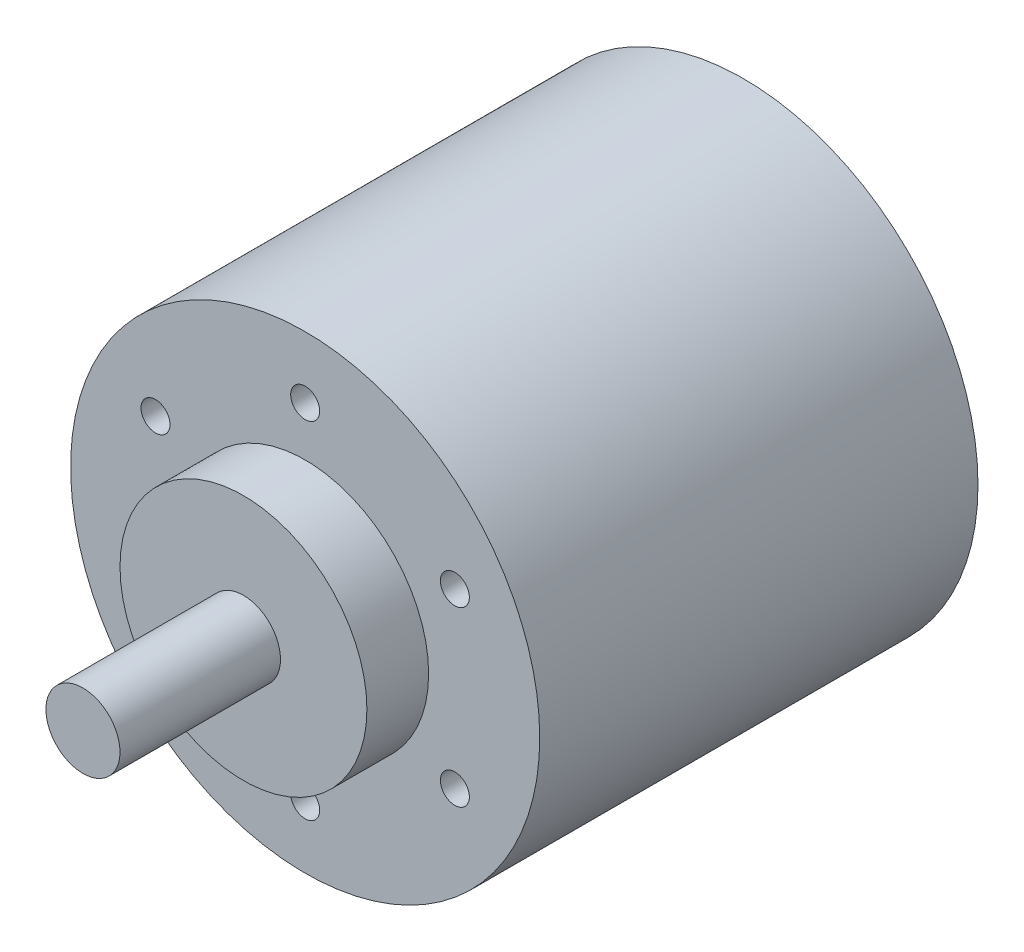
ISO-10303-21;
HEADER;
FILE_DESCRIPTION(('STEP AP214'),'2;1');
FILE_NAME('part.step','',(''),(''),'','','');
FILE_SCHEMA(('AUTOMOTIVE_DESIGN { 1 0 10303 214 1 1 1 1 }'));
ENDSEC;
DATA;
#1=APPLICATION_CONTEXT('core data for automotive mechanical design processes');
#2=APPLICATION_PROTOCOL_DEFINITION('international standard','automotive_design',2000,#1);
#3=PRODUCT_CONTEXT('',#1,'mechanical');
#4=PRODUCT('Part','Part','',(#3));
#5=PRODUCT_RELATED_PRODUCT_CATEGORY('part','',(#4));
#6=PRODUCT_DEFINITION_FORMATION('','',#4);
#7=PRODUCT_DEFINITION_CONTEXT('part definition',#1,'design');
#8=PRODUCT_DEFINITION('design','',#6,#7);
#9=PRODUCT_DEFINITION_SHAPE('','',#8);
#10=(LENGTH_UNIT() NAMED_UNIT(*) SI_UNIT(.MILLI.,.METRE.));
#11=(NAMED_UNIT(*) PLANE_ANGLE_UNIT() SI_UNIT($,.RADIAN.));
#12=(NAMED_UNIT(*) SI_UNIT($,.STERADIAN.) SOLID_ANGLE_UNIT());
#13=UNCERTAINTY_MEASURE_WITH_UNIT(LENGTH_MEASURE(1.E-05),#10,'distance_accuracy_value','');
#14=(GEOMETRIC_REPRESENTATION_CONTEXT(3) GLOBAL_UNCERTAINTY_ASSIGNED_CONTEXT((#13)) GLOBAL_UNIT_ASSIGNED_CONTEXT((#10,
#11,#12)) REPRESENTATION_CONTEXT('',''));
#15=CARTESIAN_POINT('',(0.,0.,0.));
#16=DIRECTION('',(0.,0.,1.));
#17=DIRECTION('',(1.,0.,0.));
#18=AXIS2_PLACEMENT_3D('',#15,#16,#17);
#19=CARTESIAN_POINT('',(0.,0.,5.));
#20=DIRECTION('',(0.,0.,1.));
#21=DIRECTION('',(1.,0.,0.));
#22=AXIS2_PLACEMENT_3D('',#19,#20,#21);
#23=PLANE('',#22);
#24=CARTESIAN_POINT('',(0.,0.,5.));
#25=DIRECTION('',(0.,0.,1.));
#26=DIRECTION('',(1.,0.,0.));
#27=AXIS2_PLACEMENT_3D('',#24,#25,#26);
#28=CIRCLE('',#27,10.);
#29=CARTESIAN_POINT('',(10.,0.,5.));
#30=VERTEX_POINT('',#29);
#31=EDGE_CURVE('E42',#30,#30,#28,.T.);
#32=ORIENTED_EDGE('',*,*,#31,.T.);
#33=EDGE_LOOP('',(#32));
#34=FACE_BOUND('',#33,.T.);
#35=CARTESIAN_POINT('',(0.,0.,5.));
#36=DIRECTION('',(0.,0.,1.));
#37=DIRECTION('',(1.,0.,0.));
#38=AXIS2_PLACEMENT_3D('',#35,#36,#37);
#39=CIRCLE('',#38,3.);
#40=CARTESIAN_POINT('',(3.,0.,5.));
#41=VERTEX_POINT('',#40);
#42=EDGE_CURVE('E50',#41,#41,#39,.T.);
#43=ORIENTED_EDGE('',*,*,#42,.F.);
#44=EDGE_LOOP('',(#43));
#45=FACE_BOUND('',#44,.T.);
#46=ADVANCED_FACE('F31',(#34,#45),#23,.T.);
#47=CARTESIAN_POINT('',(0.,0.,0.));
#48=DIRECTION('',(0.,0.,1.));
#49=DIRECTION('',(1.,0.,0.));
#50=AXIS2_PLACEMENT_3D('',#47,#48,#49);
#51=PLANE('',#50);
#52=CARTESIAN_POINT('',(12.1243556529821,7.00000000000014,0.));
#53=DIRECTION('',(0.,0.,1.));
#54=DIRECTION('',(0.50000000000001,-0.866025403784433,0.));
#55=AXIS2_PLACEMENT_3D('',#52,#53,#54);
#56=CIRCLE('',#55,1.17428668758012);
#57=CARTESIAN_POINT('',(12.7114989967721,5.98303789722988,0.));
#58=VERTEX_POINT('',#57);
#59=EDGE_CURVE('E86',#58,#58,#56,.T.);
#60=ORIENTED_EDGE('',*,*,#59,.F.);
#61=EDGE_LOOP('',(#60));
#62=FACE_BOUND('',#61,.T.);
#63=CARTESIAN_POINT('',(12.1243556529822,-6.99999999999989,0.));
#64=DIRECTION('',(0.,0.,1.));
#65=DIRECTION('',(-0.499999999999992,-0.866025403784443,0.));
#66=AXIS2_PLACEMENT_3D('',#63,#64,#65);
#67=CIRCLE('',#66,1.17428668758012);
#68=CARTESIAN_POINT('',(11.5372123091922,-8.01696210277016,0.));
#69=VERTEX_POINT('',#68);
#70=EDGE_CURVE('E80',#69,#69,#67,.T.);
#71=ORIENTED_EDGE('',*,*,#70,.F.);
#72=EDGE_LOOP('',(#71));
#73=FACE_BOUND('',#72,.T.);
#74=CARTESIAN_POINT('',(0.,-14.,0.));
#75=DIRECTION('',(0.,0.,1.));
#76=DIRECTION('',(-1.,0.,0.));
#77=AXIS2_PLACEMENT_3D('',#74,#75,#76);
#78=CIRCLE('',#77,1.17428668758012);
#79=CARTESIAN_POINT('',(-1.17428668758012,-14.,0.));
#80=VERTEX_POINT('',#79);
#81=EDGE_CURVE('E74',#80,#80,#78,.T.);
#82=ORIENTED_EDGE('',*,*,#81,.F.);
#83=EDGE_LOOP('',(#82));
#84=FACE_BOUND('',#83,.T.);
#85=CARTESIAN_POINT('',(-12.1243556529821,-7.00000000000006,0.));
#86=DIRECTION('',(0.,0.,1.));
#87=DIRECTION('',(-0.500000000000004,0.866025403784436,0.));
#88=AXIS2_PLACEMENT_3D('',#85,#86,#87);
#89=CIRCLE('',#88,1.17428668758012);
#90=CARTESIAN_POINT('',(-12.7114989967722,-5.98303789722979,0.));
#91=VERTEX_POINT('',#90);
#92=EDGE_CURVE('E68',#91,#91,#89,.T.);
#93=ORIENTED_EDGE('',*,*,#92,.F.);
#94=EDGE_LOOP('',(#93));
#95=FACE_BOUND('',#94,.T.);
#96=CARTESIAN_POINT('',(-12.1243556529822,6.99999999999997,0.));
#97=DIRECTION('',(0.,0.,1.));
#98=DIRECTION('',(0.499999999999998,0.86602540378444,0.));
#99=AXIS2_PLACEMENT_3D('',#96,#97,#98);
#100=CIRCLE('',#99,1.17428668758012);
#101=CARTESIAN_POINT('',(-11.5372123091921,8.01696210277024,0.));
#102=VERTEX_POINT('',#101);
#103=EDGE_CURVE('E62',#102,#102,#100,.T.);
#104=ORIENTED_EDGE('',*,*,#103,.F.);
#105=EDGE_LOOP('',(#104));
#106=FACE_BOUND('',#105,.T.);
#107=CARTESIAN_POINT('',(0.,14.,0.));
#108=DIRECTION('',(0.,0.,1.));
#109=DIRECTION('',(1.,0.,0.));
#110=AXIS2_PLACEMENT_3D('',#107,#108,#109);
#111=CIRCLE('',#110,1.17428668758012);
#112=CARTESIAN_POINT('',(1.17428668758012,14.,0.));
#113=VERTEX_POINT('',#112);
#114=EDGE_CURVE('E56',#113,#113,#111,.T.);
#115=ORIENTED_EDGE('',*,*,#114,.F.);
#116=EDGE_LOOP('',(#115));
#117=FACE_BOUND('',#116,.T.);
#118=CARTESIAN_POINT('',(0.,0.,0.));
#119=DIRECTION('',(0.,0.,1.));
#120=DIRECTION('',(1.,0.,0.));
#121=AXIS2_PLACEMENT_3D('',#118,#119,#120);
#122=CIRCLE('',#121,19.);
#123=CARTESIAN_POINT('',(19.,0.,0.));
#124=VERTEX_POINT('',#123);
#125=EDGE_CURVE('E35',#124,#124,#122,.T.);
#126=ORIENTED_EDGE('',*,*,#125,.T.);
#127=EDGE_LOOP('',(#126));
#128=FACE_BOUND('',#127,.T.);
#129=CARTESIAN_POINT('',(0.,0.,0.));
#130=DIRECTION('',(0.,0.,1.));
#131=DIRECTION('',(1.,0.,0.));
#132=AXIS2_PLACEMENT_3D('',#129,#130,#131);
#133=CIRCLE('',#132,10.);
#134=CARTESIAN_POINT('',(10.,0.,0.));
#135=VERTEX_POINT('',#134);
#136=EDGE_CURVE('E44',#135,#135,#133,.T.);
#137=ORIENTED_EDGE('',*,*,#136,.F.);
#138=EDGE_LOOP('',(#137));
#139=FACE_BOUND('',#138,.T.);
#140=ADVANCED_FACE('F101',(#62,#73,#84,#95,#106,#117,#128,#139),#51,.T.);
#141=CARTESIAN_POINT('',(0.,0.,-35.5));
#142=DIRECTION('',(0.,0.,1.));
#143=DIRECTION('',(1.,0.,0.));
#144=AXIS2_PLACEMENT_3D('',#141,#142,#143);
#145=CYLINDRICAL_SURFACE('',#144,19.);
#146=CARTESIAN_POINT('',(0.,0.,-35.5));
#147=DIRECTION('',(0.,0.,1.));
#148=DIRECTION('',(1.,0.,0.));
#149=AXIS2_PLACEMENT_3D('',#146,#147,#148);
#150=CIRCLE('',#149,19.);
#151=CARTESIAN_POINT('',(19.,0.,-35.5));
#152=VERTEX_POINT('',#151);
#153=EDGE_CURVE('E10',#152,#152,#150,.T.);
#154=ORIENTED_EDGE('',*,*,#153,.T.);
#155=EDGE_LOOP('',(#154));
#156=FACE_BOUND('',#155,.T.);
#157=ORIENTED_EDGE('',*,*,#125,.F.);
#158=EDGE_LOOP('',(#157));
#159=FACE_BOUND('',#158,.T.);
#160=ADVANCED_FACE('F33',(#156,#159),#145,.T.);
#161=CARTESIAN_POINT('',(0.,0.,-35.5));
#162=DIRECTION('',(0.,0.,1.));
#163=DIRECTION('',(1.,0.,0.));
#164=AXIS2_PLACEMENT_3D('',#161,#162,#163);
#165=PLANE('',#164);
#166=ORIENTED_EDGE('',*,*,#153,.F.);
#167=EDGE_LOOP('',(#166));
#168=FACE_BOUND('',#167,.T.);
#169=ADVANCED_FACE('F121',(#168),#165,.F.);
#170=CARTESIAN_POINT('',(0.,0.,5.));
#171=DIRECTION('',(0.,0.,-1.));
#172=DIRECTION('',(-1.,0.,0.));
#173=AXIS2_PLACEMENT_3D('',#170,#171,#172);
#174=CYLINDRICAL_SURFACE('',#173,10.);
#175=ORIENTED_EDGE('',*,*,#31,.F.);
#176=EDGE_LOOP('',(#175));
#177=FACE_BOUND('',#176,.T.);
#178=ORIENTED_EDGE('',*,*,#136,.T.);
#179=EDGE_LOOP('',(#178));
#180=FACE_BOUND('',#179,.T.);
#181=ADVANCED_FACE('F118',(#177,#180),#174,.T.);
#182=CARTESIAN_POINT('',(0.,0.,18.));
#183=DIRECTION('',(0.,0.,-1.));
#184=DIRECTION('',(-1.,0.,0.));
#185=AXIS2_PLACEMENT_3D('',#182,#183,#184);
#186=CYLINDRICAL_SURFACE('',#185,3.);
#187=CARTESIAN_POINT('',(0.,0.,18.));
#188=DIRECTION('',(0.,0.,1.));
#189=DIRECTION('',(1.,0.,0.));
#190=AXIS2_PLACEMENT_3D('',#187,#188,#189);
#191=CIRCLE('',#190,3.);
#192=CARTESIAN_POINT('',(3.,0.,18.));
#193=VERTEX_POINT('',#192);
#194=EDGE_CURVE('E47',#193,#193,#191,.T.);
#195=ORIENTED_EDGE('',*,*,#194,.F.);
#196=EDGE_LOOP('',(#195));
#197=FACE_BOUND('',#196,.T.);
#198=ORIENTED_EDGE('',*,*,#42,.T.);
#199=EDGE_LOOP('',(#198));
#200=FACE_BOUND('',#199,.T.);
#201=ADVANCED_FACE('F120',(#197,#200),#186,.T.);
#202=CARTESIAN_POINT('',(0.,0.,18.));
#203=DIRECTION('',(0.,0.,1.));
#204=DIRECTION('',(1.,0.,0.));
#205=AXIS2_PLACEMENT_3D('',#202,#203,#204);
#206=PLANE('',#205);
#207=ORIENTED_EDGE('',*,*,#194,.T.);
#208=EDGE_LOOP('',(#207));
#209=FACE_BOUND('',#208,.T.);
#210=ADVANCED_FACE('F128',(#209),#206,.T.);
#211=CARTESIAN_POINT('',(0.,14.,-5.));
#212=DIRECTION('',(0.,0.,1.));
#213=DIRECTION('',(1.,0.,0.));
#214=AXIS2_PLACEMENT_3D('',#211,#212,#213);
#215=CYLINDRICAL_SURFACE('',#214,1.17428668758012);
#216=CARTESIAN_POINT('',(0.,14.,-5.));
#217=DIRECTION('',(0.,0.,1.));
#218=DIRECTION('',(1.,0.,0.));
#219=AXIS2_PLACEMENT_3D('',#216,#217,#218);
#220=CIRCLE('',#219,1.17428668758012);
#221=CARTESIAN_POINT('',(1.17428668758012,14.,-5.));
#222=VERTEX_POINT('',#221);
#223=EDGE_CURVE('E53',#222,#222,#220,.T.);
#224=ORIENTED_EDGE('',*,*,#223,.F.);
#225=EDGE_LOOP('',(#224));
#226=FACE_BOUND('',#225,.T.);
#227=ORIENTED_EDGE('',*,*,#114,.T.);
#228=EDGE_LOOP('',(#227));
#229=FACE_BOUND('',#228,.T.);
#230=ADVANCED_FACE('F143',(#226,#229),#215,.F.);
#231=CARTESIAN_POINT('',(0.,14.,-5.));
#232=DIRECTION('',(0.,0.,1.));
#233=DIRECTION('',(1.,0.,0.));
#234=AXIS2_PLACEMENT_3D('',#231,#232,#233);
#235=PLANE('',#234);
#236=ORIENTED_EDGE('',*,*,#223,.T.);
#237=EDGE_LOOP('',(#236));
#238=FACE_BOUND('',#237,.T.);
#239=ADVANCED_FACE('F147',(#238),#235,.T.);
#240=CARTESIAN_POINT('',(-12.1243556529822,6.99999999999997,-5.));
#241=DIRECTION('',(0.,0.,1.));
#242=DIRECTION('',(1.,0.,0.));
#243=AXIS2_PLACEMENT_3D('',#240,#241,#242);
#244=CYLINDRICAL_SURFACE('',#243,1.17428668758012);
#245=CARTESIAN_POINT('',(-12.1243556529822,6.99999999999997,-5.));
#246=DIRECTION('',(0.,0.,1.));
#247=DIRECTION('',(0.499999999999998,0.86602540378444,0.));
#248=AXIS2_PLACEMENT_3D('',#245,#246,#247);
#249=CIRCLE('',#248,1.17428668758012);
#250=CARTESIAN_POINT('',(-11.5372123091921,8.01696210277024,-5.));
#251=VERTEX_POINT('',#250);
#252=EDGE_CURVE('E59',#251,#251,#249,.T.);
#253=ORIENTED_EDGE('',*,*,#252,.F.);
#254=EDGE_LOOP('',(#253));
#255=FACE_BOUND('',#254,.T.);
#256=ORIENTED_EDGE('',*,*,#103,.T.);
#257=EDGE_LOOP('',(#256));
#258=FACE_BOUND('',#257,.T.);
#259=ADVANCED_FACE('F151',(#255,#258),#244,.F.);
#260=CARTESIAN_POINT('',(-12.1243556529822,6.99999999999997,-5.));
#261=DIRECTION('',(0.,0.,1.));
#262=DIRECTION('',(0.499999999999998,0.86602540378444,0.));
#263=AXIS2_PLACEMENT_3D('',#260,#261,#262);
#264=PLANE('',#263);
#265=ORIENTED_EDGE('',*,*,#252,.T.);
#266=EDGE_LOOP('',(#265));
#267=FACE_BOUND('',#266,.T.);
#268=ADVANCED_FACE('F155',(#267),#264,.T.);
#269=CARTESIAN_POINT('',(-12.1243556529821,-7.00000000000006,-5.));
#270=DIRECTION('',(0.,0.,1.));
#271=DIRECTION('',(1.,0.,0.));
#272=AXIS2_PLACEMENT_3D('',#269,#270,#271);
#273=CYLINDRICAL_SURFACE('',#272,1.17428668758012);
#274=CARTESIAN_POINT('',(-12.1243556529821,-7.00000000000006,-5.));
#275=DIRECTION('',(0.,0.,1.));
#276=DIRECTION('',(-0.500000000000004,0.866025403784436,0.));
#277=AXIS2_PLACEMENT_3D('',#274,#275,#276);
#278=CIRCLE('',#277,1.17428668758012);
#279=CARTESIAN_POINT('',(-12.7114989967722,-5.98303789722979,-5.));
#280=VERTEX_POINT('',#279);
#281=EDGE_CURVE('E65',#280,#280,#278,.T.);
#282=ORIENTED_EDGE('',*,*,#281,.F.);
#283=EDGE_LOOP('',(#282));
#284=FACE_BOUND('',#283,.T.);
#285=ORIENTED_EDGE('',*,*,#92,.T.);
#286=EDGE_LOOP('',(#285));
#287=FACE_BOUND('',#286,.T.);
#288=ADVANCED_FACE('F159',(#284,#287),#273,.F.);
#289=CARTESIAN_POINT('',(-12.1243556529821,-7.00000000000006,-5.));
#290=DIRECTION('',(0.,0.,1.));
#291=DIRECTION('',(-0.500000000000004,0.866025403784436,0.));
#292=AXIS2_PLACEMENT_3D('',#289,#290,#291);
#293=PLANE('',#292);
#294=ORIENTED_EDGE('',*,*,#281,.T.);
#295=EDGE_LOOP('',(#294));
#296=FACE_BOUND('',#295,.T.);
#297=ADVANCED_FACE('F163',(#296),#293,.T.);
#298=CARTESIAN_POINT('',(0.,-14.,-5.));
#299=DIRECTION('',(0.,0.,1.));
#300=DIRECTION('',(1.,0.,0.));
#301=AXIS2_PLACEMENT_3D('',#298,#299,#300);
#302=CYLINDRICAL_SURFACE('',#301,1.17428668758012);
#303=CARTESIAN_POINT('',(0.,-14.,-5.));
#304=DIRECTION('',(0.,0.,1.));
#305=DIRECTION('',(-1.,0.,0.));
#306=AXIS2_PLACEMENT_3D('',#303,#304,#305);
#307=CIRCLE('',#306,1.17428668758012);
#308=CARTESIAN_POINT('',(-1.17428668758012,-14.,-5.));
#309=VERTEX_POINT('',#308);
#310=EDGE_CURVE('E71',#309,#309,#307,.T.);
#311=ORIENTED_EDGE('',*,*,#310,.F.);
#312=EDGE_LOOP('',(#311));
#313=FACE_BOUND('',#312,.T.);
#314=ORIENTED_EDGE('',*,*,#81,.T.);
#315=EDGE_LOOP('',(#314));
#316=FACE_BOUND('',#315,.T.);
#317=ADVANCED_FACE('F167',(#313,#316),#302,.F.);
#318=CARTESIAN_POINT('',(0.,-14.,-5.));
#319=DIRECTION('',(0.,0.,1.));
#320=DIRECTION('',(-1.,0.,0.));
#321=AXIS2_PLACEMENT_3D('',#318,#319,#320);
#322=PLANE('',#321);
#323=ORIENTED_EDGE('',*,*,#310,.T.);
#324=EDGE_LOOP('',(#323));
#325=FACE_BOUND('',#324,.T.);
#326=ADVANCED_FACE('F171',(#325),#322,.T.);
#327=CARTESIAN_POINT('',(12.1243556529822,-6.99999999999989,-5.));
#328=DIRECTION('',(0.,0.,1.));
#329=DIRECTION('',(1.,0.,0.));
#330=AXIS2_PLACEMENT_3D('',#327,#328,#329);
#331=CYLINDRICAL_SURFACE('',#330,1.17428668758012);
#332=CARTESIAN_POINT('',(12.1243556529822,-6.99999999999989,-5.));
#333=DIRECTION('',(0.,0.,1.));
#334=DIRECTION('',(-0.499999999999992,-0.866025403784443,0.));
#335=AXIS2_PLACEMENT_3D('',#332,#333,#334);
#336=CIRCLE('',#335,1.17428668758012);
#337=CARTESIAN_POINT('',(11.5372123091922,-8.01696210277016,-5.));
#338=VERTEX_POINT('',#337);
#339=EDGE_CURVE('E77',#338,#338,#336,.T.);
#340=ORIENTED_EDGE('',*,*,#339,.F.);
#341=EDGE_LOOP('',(#340));
#342=FACE_BOUND('',#341,.T.);
#343=ORIENTED_EDGE('',*,*,#70,.T.);
#344=EDGE_LOOP('',(#343));
#345=FACE_BOUND('',#344,.T.);
#346=ADVANCED_FACE('F175',(#342,#345),#331,.F.);
#347=CARTESIAN_POINT('',(12.1243556529822,-6.99999999999989,-5.));
#348=DIRECTION('',(0.,0.,1.));
#349=DIRECTION('',(-0.499999999999992,-0.866025403784443,0.));
#350=AXIS2_PLACEMENT_3D('',#347,#348,#349);
#351=PLANE('',#350);
#352=ORIENTED_EDGE('',*,*,#339,.T.);
#353=EDGE_LOOP('',(#352));
#354=FACE_BOUND('',#353,.T.);
#355=ADVANCED_FACE('F97',(#354),#351,.T.);
#356=CARTESIAN_POINT('',(12.1243556529821,7.00000000000014,-5.));
#357=DIRECTION('',(0.,0.,1.));
#358=DIRECTION('',(1.,0.,0.));
#359=AXIS2_PLACEMENT_3D('',#356,#357,#358);
#360=CYLINDRICAL_SURFACE('',#359,1.17428668758012);
#361=CARTESIAN_POINT('',(12.1243556529821,7.00000000000014,-5.));
#362=DIRECTION('',(0.,0.,1.));
#363=DIRECTION('',(0.50000000000001,-0.866025403784433,0.));
#364=AXIS2_PLACEMENT_3D('',#361,#362,#363);
#365=CIRCLE('',#364,1.17428668758012);
#366=CARTESIAN_POINT('',(12.7114989967721,5.98303789722988,-5.));
#367=VERTEX_POINT('',#366);
#368=EDGE_CURVE('E83',#367,#367,#365,.T.);
#369=ORIENTED_EDGE('',*,*,#368,.F.);
#370=EDGE_LOOP('',(#369));
#371=FACE_BOUND('',#370,.T.);
#372=ORIENTED_EDGE('',*,*,#59,.T.);
#373=EDGE_LOOP('',(#372));
#374=FACE_BOUND('',#373,.T.);
#375=ADVANCED_FACE('F94',(#371,#374),#360,.F.);
#376=CARTESIAN_POINT('',(12.1243556529821,7.00000000000014,-5.));
#377=DIRECTION('',(0.,0.,1.));
#378=DIRECTION('',(0.50000000000001,-0.866025403784433,0.));
#379=AXIS2_PLACEMENT_3D('',#376,#377,#378);
#380=PLANE('',#379);
#381=ORIENTED_EDGE('',*,*,#368,.T.);
#382=EDGE_LOOP('',(#381));
#383=FACE_BOUND('',#382,.T.);
#384=ADVANCED_FACE('F92',(#383),#380,.T.);
#385=CLOSED_SHELL('',(#46,#140,#160,#169,#181,#201,#210,#230,#239,#259,#268,#288,#297,#317,#326,
#346,#355,#375,#384));
#386=MANIFOLD_SOLID_BREP('B2',#385);
#387=ADVANCED_BREP_SHAPE_REPRESENTATION('',(#18,#386),#14);
#388=SHAPE_DEFINITION_REPRESENTATION(#9,#387);
ENDSEC;
END-ISO-10303-21;
